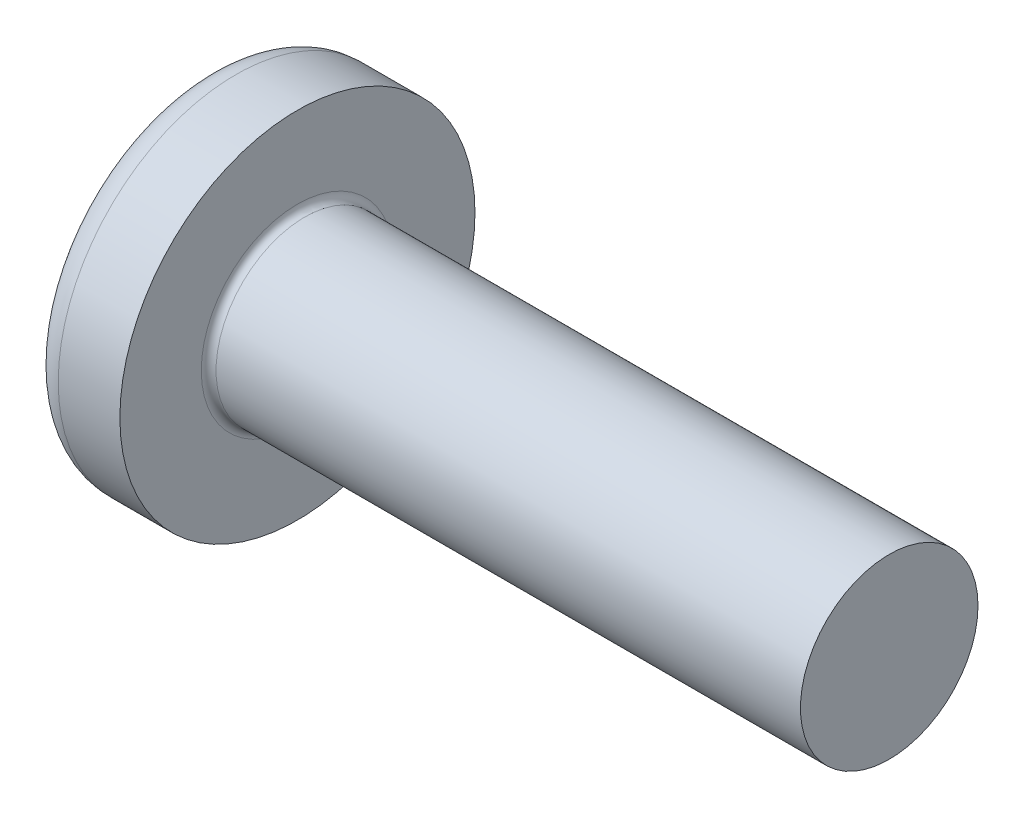
ISO-10303-21;
HEADER;
FILE_DESCRIPTION(('STEP AP214'),'2;1');
FILE_NAME('part.step','',(''),(''),'','','');
FILE_SCHEMA(('AUTOMOTIVE_DESIGN { 1 0 10303 214 1 1 1 1 }'));
ENDSEC;
DATA;
#1=APPLICATION_CONTEXT('core data for automotive mechanical design processes');
#2=APPLICATION_PROTOCOL_DEFINITION('international standard','automotive_design',2000,#1);
#3=PRODUCT_CONTEXT('',#1,'mechanical');
#4=PRODUCT('Part','Part','',(#3));
#5=PRODUCT_RELATED_PRODUCT_CATEGORY('part','',(#4));
#6=PRODUCT_DEFINITION_FORMATION('','',#4);
#7=PRODUCT_DEFINITION_CONTEXT('part definition',#1,'design');
#8=PRODUCT_DEFINITION('design','',#6,#7);
#9=PRODUCT_DEFINITION_SHAPE('','',#8);
#10=(LENGTH_UNIT() NAMED_UNIT(*) SI_UNIT(.MILLI.,.METRE.));
#11=(NAMED_UNIT(*) PLANE_ANGLE_UNIT() SI_UNIT($,.RADIAN.));
#12=(NAMED_UNIT(*) SI_UNIT($,.STERADIAN.) SOLID_ANGLE_UNIT());
#13=UNCERTAINTY_MEASURE_WITH_UNIT(LENGTH_MEASURE(1.E-05),#10,'distance_accuracy_value','');
#14=(GEOMETRIC_REPRESENTATION_CONTEXT(3) GLOBAL_UNCERTAINTY_ASSIGNED_CONTEXT((#13)) GLOBAL_UNIT_ASSIGNED_CONTEXT((#10,
#11,#12)) REPRESENTATION_CONTEXT('',''));
#15=CARTESIAN_POINT('',(0.,0.,0.));
#16=DIRECTION('',(0.,0.,1.));
#17=DIRECTION('',(1.,0.,0.));
#18=AXIS2_PLACEMENT_3D('',#15,#16,#17);
#19=CARTESIAN_POINT('',(10.,0.,0.));
#20=DIRECTION('',(-1.,0.,0.));
#21=DIRECTION('',(0.,-1.,0.));
#22=AXIS2_PLACEMENT_3D('',#19,#20,#21);
#23=SPHERICAL_SURFACE('',#22,10.);
#24=CARTESIAN_POINT('',(1.68520580716902,0.,0.));
#25=DIRECTION('',(1.,0.,0.));
#26=DIRECTION('',(0.,0.,-1.));
#27=AXIS2_PLACEMENT_3D('',#24,#25,#26);
#28=CIRCLE('',#27,5.55555555555556);
#29=CARTESIAN_POINT('',(1.68520580716902,0.,-5.55555555555556));
#30=VERTEX_POINT('',#29);
#31=EDGE_CURVE('E46',#30,#30,#28,.F.);
#32=ORIENTED_EDGE('',*,*,#31,.T.);
#33=EDGE_LOOP('',(#32));
#34=FACE_BOUND('',#33,.T.);
#35=CARTESIAN_POINT('',(10.,-2.075,0.));
#36=DIRECTION('',(0.,1.,0.));
#37=DIRECTION('',(0.,0.,1.));
#38=AXIS2_PLACEMENT_3D('',#35,#36,#37);
#39=CIRCLE('',#38,9.78235017774358);
#40=CARTESIAN_POINT('',(0.291283984652422,-2.075,1.19800180856847));
#41=VERTEX_POINT('',#40);
#42=CARTESIAN_POINT('',(0.291283984652422,-2.075,-1.19800180856848));
#43=VERTEX_POINT('',#42);
#44=EDGE_CURVE('E152',#41,#43,#39,.F.);
#45=ORIENTED_EDGE('',*,*,#44,.T.);
#46=CARTESIAN_POINT('',(10.,-1.0375,-1.79700271285271));
#47=DIRECTION('',(0.,0.5,0.866025403784439));
#48=DIRECTION('',(0.,-0.866025403784439,0.5));
#49=AXIS2_PLACEMENT_3D('',#46,#47,#48);
#50=CIRCLE('',#49,9.78235017774358);
#51=CARTESIAN_POINT('',(0.29128398465242,0.,-2.39600361713695));
#52=VERTEX_POINT('',#51);
#53=EDGE_CURVE('E162',#43,#52,#50,.F.);
#54=ORIENTED_EDGE('',*,*,#53,.T.);
#55=CARTESIAN_POINT('',(10.,1.0375,-1.79700271285271));
#56=DIRECTION('',(0.,-0.5,0.866025403784439));
#57=DIRECTION('',(0.,-0.866025403784439,-0.5));
#58=AXIS2_PLACEMENT_3D('',#55,#56,#57);
#59=CIRCLE('',#58,9.78235017774359);
#60=CARTESIAN_POINT('',(0.29128398465242,2.075,-1.19800180856847));
#61=VERTEX_POINT('',#60);
#62=EDGE_CURVE('E61',#52,#61,#59,.F.);
#63=ORIENTED_EDGE('',*,*,#62,.T.);
#64=CARTESIAN_POINT('',(10.,2.075,0.));
#65=DIRECTION('',(0.,-1.,0.));
#66=DIRECTION('',(0.,0.,-1.));
#67=AXIS2_PLACEMENT_3D('',#64,#65,#66);
#68=CIRCLE('',#67,9.78235017774359);
#69=CARTESIAN_POINT('',(0.29128398465242,2.075,1.19800180856847));
#70=VERTEX_POINT('',#69);
#71=EDGE_CURVE('E159',#61,#70,#68,.F.);
#72=ORIENTED_EDGE('',*,*,#71,.T.);
#73=CARTESIAN_POINT('',(10.,1.0375,1.79700271285271));
#74=DIRECTION('',(0.,-0.5,-0.866025403784439));
#75=DIRECTION('',(0.,0.866025403784438,-0.5));
#76=AXIS2_PLACEMENT_3D('',#73,#74,#75);
#77=CIRCLE('',#76,9.78235017774359);
#78=CARTESIAN_POINT('',(0.29128398465242,0.,2.39600361713695));
#79=VERTEX_POINT('',#78);
#80=EDGE_CURVE('E129',#70,#79,#77,.F.);
#81=ORIENTED_EDGE('',*,*,#80,.T.);
#82=CARTESIAN_POINT('',(10.,-1.0375,1.79700271285271));
#83=DIRECTION('',(0.,0.5,-0.866025403784438));
#84=DIRECTION('',(0.,0.866025403784438,0.5));
#85=AXIS2_PLACEMENT_3D('',#82,#83,#84);
#86=CIRCLE('',#85,9.78235017774359);
#87=EDGE_CURVE('E155',#79,#41,#86,.F.);
#88=ORIENTED_EDGE('',*,*,#87,.T.);
#89=EDGE_LOOP('',(#45,#54,#63,#72,#81,#88));
#90=FACE_BOUND('',#89,.T.);
#91=ADVANCED_FACE('F38',(#34,#90),#23,.T.);
#92=CARTESIAN_POINT('',(4.6,0.,0.));
#93=DIRECTION('',(-1.,0.,0.));
#94=DIRECTION('',(0.,0.,1.));
#95=AXIS2_PLACEMENT_3D('',#92,#93,#94);
#96=CYLINDRICAL_SURFACE('',#95,6.);
#97=CARTESIAN_POINT('',(2.51668522645212,0.,0.));
#98=DIRECTION('',(1.,0.,0.));
#99=DIRECTION('',(0.,0.,-1.));
#100=AXIS2_PLACEMENT_3D('',#97,#98,#99);
#101=CIRCLE('',#100,6.);
#102=CARTESIAN_POINT('',(2.51668522645212,0.,-6.));
#103=VERTEX_POINT('',#102);
#104=EDGE_CURVE('E11',#103,#103,#101,.T.);
#105=ORIENTED_EDGE('',*,*,#104,.T.);
#106=EDGE_LOOP('',(#105));
#107=FACE_BOUND('',#106,.T.);
#108=CARTESIAN_POINT('',(4.6,0.,0.));
#109=DIRECTION('',(1.,0.,0.));
#110=DIRECTION('',(0.,0.,-1.));
#111=AXIS2_PLACEMENT_3D('',#108,#109,#110);
#112=CIRCLE('',#111,6.);
#113=CARTESIAN_POINT('',(4.6,0.,-6.));
#114=VERTEX_POINT('',#113);
#115=EDGE_CURVE('E142',#114,#114,#112,.T.);
#116=ORIENTED_EDGE('',*,*,#115,.F.);
#117=EDGE_LOOP('',(#116));
#118=FACE_BOUND('',#117,.T.);
#119=ADVANCED_FACE('F178',(#107,#118),#96,.T.);
#120=CARTESIAN_POINT('',(4.6,0.,0.));
#121=DIRECTION('',(1.,0.,0.));
#122=DIRECTION('',(0.,0.,-1.));
#123=AXIS2_PLACEMENT_3D('',#120,#121,#122);
#124=PLANE('',#123);
#125=CARTESIAN_POINT('',(4.6,0.,0.));
#126=DIRECTION('',(1.,0.,0.));
#127=DIRECTION('',(0.,0.,-1.));
#128=AXIS2_PLACEMENT_3D('',#125,#126,#127);
#129=CIRCLE('',#128,3.25);
#130=CARTESIAN_POINT('',(4.6,0.,-3.25));
#131=VERTEX_POINT('',#130);
#132=EDGE_CURVE('E149',#131,#131,#129,.F.);
#133=ORIENTED_EDGE('',*,*,#132,.T.);
#134=EDGE_LOOP('',(#133));
#135=FACE_BOUND('',#134,.T.);
#136=ORIENTED_EDGE('',*,*,#115,.T.);
#137=EDGE_LOOP('',(#136));
#138=FACE_BOUND('',#137,.T.);
#139=ADVANCED_FACE('F183',(#135,#138),#124,.T.);
#140=CARTESIAN_POINT('',(24.6,0.,0.));
#141=DIRECTION('',(-1.,0.,0.));
#142=DIRECTION('',(0.,0.,1.));
#143=AXIS2_PLACEMENT_3D('',#140,#141,#142);
#144=CYLINDRICAL_SURFACE('',#143,3.);
#145=CARTESIAN_POINT('',(4.85,0.,0.));
#146=DIRECTION('',(1.,0.,0.));
#147=DIRECTION('',(0.,0.,-1.));
#148=AXIS2_PLACEMENT_3D('',#145,#146,#147);
#149=CIRCLE('',#148,3.);
#150=CARTESIAN_POINT('',(4.85,0.,-3.));
#151=VERTEX_POINT('',#150);
#152=EDGE_CURVE('E146',#151,#151,#149,.T.);
#153=ORIENTED_EDGE('',*,*,#152,.T.);
#154=EDGE_LOOP('',(#153));
#155=FACE_BOUND('',#154,.T.);
#156=CARTESIAN_POINT('',(24.6,0.,0.));
#157=DIRECTION('',(1.,0.,0.));
#158=DIRECTION('',(0.,0.,-1.));
#159=AXIS2_PLACEMENT_3D('',#156,#157,#158);
#160=CIRCLE('',#159,3.);
#161=CARTESIAN_POINT('',(24.6,0.,-3.));
#162=VERTEX_POINT('',#161);
#163=EDGE_CURVE('E139',#162,#162,#160,.T.);
#164=ORIENTED_EDGE('',*,*,#163,.F.);
#165=EDGE_LOOP('',(#164));
#166=FACE_BOUND('',#165,.T.);
#167=ADVANCED_FACE('F194',(#155,#166),#144,.T.);
#168=CARTESIAN_POINT('',(24.6,0.,0.));
#169=DIRECTION('',(1.,0.,0.));
#170=DIRECTION('',(0.,0.,-1.));
#171=AXIS2_PLACEMENT_3D('',#168,#169,#170);
#172=PLANE('',#171);
#173=ORIENTED_EDGE('',*,*,#163,.T.);
#174=EDGE_LOOP('',(#173));
#175=FACE_BOUND('',#174,.T.);
#176=ADVANCED_FACE('F190',(#175),#172,.T.);
#177=CARTESIAN_POINT('',(4.85,0.,0.));
#178=DIRECTION('',(1.,0.,0.));
#179=DIRECTION('',(0.,0.,-1.));
#180=AXIS2_PLACEMENT_3D('',#177,#178,#179);
#181=TOROIDAL_SURFACE('',#180,3.25,0.25);
#182=ORIENTED_EDGE('',*,*,#132,.F.);
#183=EDGE_LOOP('',(#182));
#184=FACE_BOUND('',#183,.T.);
#185=ORIENTED_EDGE('',*,*,#152,.F.);
#186=EDGE_LOOP('',(#185));
#187=FACE_BOUND('',#186,.T.);
#188=ADVANCED_FACE('F193',(#184,#187),#181,.F.);
#189=CARTESIAN_POINT('',(2.,-2.075,-1.19800180856848));
#190=DIRECTION('',(0.,0.5,0.866025403784439));
#191=DIRECTION('',(0.,-0.866025403784439,0.5));
#192=AXIS2_PLACEMENT_3D('',#189,#190,#191);
#193=PLANE('',#192);
#194=DIRECTION('',(-1.,0.,0.));
#195=VECTOR('',#194,1.);
#196=CARTESIAN_POINT('',(2.,-2.075,-1.19800180856848));
#197=LINE('',#196,#195);
#198=CARTESIAN_POINT('',(2.,-2.075,-1.19800180856848));
#199=VERTEX_POINT('',#198);
#200=EDGE_CURVE('E53',#199,#43,#197,.T.);
#201=ORIENTED_EDGE('',*,*,#200,.F.);
#202=DIRECTION('',(0.,0.866025403784439,-0.5));
#203=VECTOR('',#202,1.);
#204=CARTESIAN_POINT('',(2.,-2.075,-1.19800180856848));
#205=LINE('',#204,#203);
#206=CARTESIAN_POINT('',(2.,0.,-2.39600361713695));
#207=VERTEX_POINT('',#206);
#208=EDGE_CURVE('E221',#199,#207,#205,.T.);
#209=ORIENTED_EDGE('',*,*,#208,.T.);
#210=DIRECTION('',(-1.,0.,0.));
#211=VECTOR('',#210,1.);
#212=CARTESIAN_POINT('',(2.,0.,-2.39600361713695));
#213=LINE('',#212,#211);
#214=EDGE_CURVE('E132',#207,#52,#213,.T.);
#215=ORIENTED_EDGE('',*,*,#214,.T.);
#216=ORIENTED_EDGE('',*,*,#53,.F.);
#217=EDGE_LOOP('',(#201,#209,#215,#216));
#218=FACE_BOUND('',#217,.T.);
#219=ADVANCED_FACE('F188',(#218),#193,.T.);
#220=CARTESIAN_POINT('',(2.,0.,-2.39600361713695));
#221=DIRECTION('',(0.,-0.5,0.866025403784439));
#222=DIRECTION('',(0.,-0.866025403784439,-0.5));
#223=AXIS2_PLACEMENT_3D('',#220,#221,#222);
#224=PLANE('',#223);
#225=ORIENTED_EDGE('',*,*,#214,.F.);
#226=DIRECTION('',(0.,0.866025403784438,0.5));
#227=VECTOR('',#226,1.);
#228=CARTESIAN_POINT('',(2.,0.,-2.39600361713695));
#229=LINE('',#228,#227);
#230=CARTESIAN_POINT('',(2.,2.075,-1.19800180856847));
#231=VERTEX_POINT('',#230);
#232=EDGE_CURVE('E125',#207,#231,#229,.T.);
#233=ORIENTED_EDGE('',*,*,#232,.T.);
#234=DIRECTION('',(-1.,0.,0.));
#235=VECTOR('',#234,1.);
#236=CARTESIAN_POINT('',(2.,2.075,-1.19800180856847));
#237=LINE('',#236,#235);
#238=EDGE_CURVE('E124',#231,#61,#237,.T.);
#239=ORIENTED_EDGE('',*,*,#238,.T.);
#240=ORIENTED_EDGE('',*,*,#62,.F.);
#241=EDGE_LOOP('',(#225,#233,#239,#240));
#242=FACE_BOUND('',#241,.T.);
#243=ADVANCED_FACE('F206',(#242),#224,.T.);
#244=CARTESIAN_POINT('',(2.,2.075,-1.19800180856847));
#245=DIRECTION('',(0.,-1.,0.));
#246=DIRECTION('',(0.,0.,-1.));
#247=AXIS2_PLACEMENT_3D('',#244,#245,#246);
#248=PLANE('',#247);
#249=ORIENTED_EDGE('',*,*,#238,.F.);
#250=DIRECTION('',(0.,0.,1.));
#251=VECTOR('',#250,1.);
#252=CARTESIAN_POINT('',(2.,2.075,-1.19800180856847));
#253=LINE('',#252,#251);
#254=CARTESIAN_POINT('',(2.,2.075,1.19800180856847));
#255=VERTEX_POINT('',#254);
#256=EDGE_CURVE('E101',#231,#255,#253,.T.);
#257=ORIENTED_EDGE('',*,*,#256,.T.);
#258=DIRECTION('',(-1.,0.,0.));
#259=VECTOR('',#258,1.);
#260=CARTESIAN_POINT('',(2.,2.075,1.19800180856847));
#261=LINE('',#260,#259);
#262=EDGE_CURVE('E122',#255,#70,#261,.T.);
#263=ORIENTED_EDGE('',*,*,#262,.T.);
#264=ORIENTED_EDGE('',*,*,#71,.F.);
#265=EDGE_LOOP('',(#249,#257,#263,#264));
#266=FACE_BOUND('',#265,.T.);
#267=ADVANCED_FACE('F121',(#266),#248,.T.);
#268=CARTESIAN_POINT('',(2.,2.075,1.19800180856847));
#269=DIRECTION('',(0.,-0.5,-0.866025403784439));
#270=DIRECTION('',(0.,0.866025403784438,-0.5));
#271=AXIS2_PLACEMENT_3D('',#268,#269,#270);
#272=PLANE('',#271);
#273=ORIENTED_EDGE('',*,*,#262,.F.);
#274=DIRECTION('',(0.,-0.866025403784438,0.5));
#275=VECTOR('',#274,1.);
#276=CARTESIAN_POINT('',(2.,2.075,1.19800180856847));
#277=LINE('',#276,#275);
#278=CARTESIAN_POINT('',(2.,0.,2.39600361713695));
#279=VERTEX_POINT('',#278);
#280=EDGE_CURVE('E108',#255,#279,#277,.T.);
#281=ORIENTED_EDGE('',*,*,#280,.T.);
#282=DIRECTION('',(-1.,0.,0.));
#283=VECTOR('',#282,1.);
#284=CARTESIAN_POINT('',(2.,0.,2.39600361713695));
#285=LINE('',#284,#283);
#286=EDGE_CURVE('E130',#279,#79,#285,.T.);
#287=ORIENTED_EDGE('',*,*,#286,.T.);
#288=ORIENTED_EDGE('',*,*,#80,.F.);
#289=EDGE_LOOP('',(#273,#281,#287,#288));
#290=FACE_BOUND('',#289,.T.);
#291=ADVANCED_FACE('F127',(#290),#272,.T.);
#292=CARTESIAN_POINT('',(2.,0.,2.39600361713695));
#293=DIRECTION('',(0.,0.5,-0.866025403784438));
#294=DIRECTION('',(0.,0.866025403784438,0.5));
#295=AXIS2_PLACEMENT_3D('',#292,#293,#294);
#296=PLANE('',#295);
#297=ORIENTED_EDGE('',*,*,#286,.F.);
#298=DIRECTION('',(0.,-0.866025403784438,-0.5));
#299=VECTOR('',#298,1.);
#300=CARTESIAN_POINT('',(2.,0.,2.39600361713695));
#301=LINE('',#300,#299);
#302=CARTESIAN_POINT('',(2.,-2.075,1.19800180856847));
#303=VERTEX_POINT('',#302);
#304=EDGE_CURVE('E116',#279,#303,#301,.T.);
#305=ORIENTED_EDGE('',*,*,#304,.T.);
#306=DIRECTION('',(-1.,0.,0.));
#307=VECTOR('',#306,1.);
#308=CARTESIAN_POINT('',(2.,-2.075,1.19800180856847));
#309=LINE('',#308,#307);
#310=EDGE_CURVE('E134',#303,#41,#309,.T.);
#311=ORIENTED_EDGE('',*,*,#310,.T.);
#312=ORIENTED_EDGE('',*,*,#87,.F.);
#313=EDGE_LOOP('',(#297,#305,#311,#312));
#314=FACE_BOUND('',#313,.T.);
#315=ADVANCED_FACE('F245',(#314),#296,.T.);
#316=CARTESIAN_POINT('',(2.,-2.075,1.19800180856847));
#317=DIRECTION('',(0.,1.,0.));
#318=DIRECTION('',(0.,0.,1.));
#319=AXIS2_PLACEMENT_3D('',#316,#317,#318);
#320=PLANE('',#319);
#321=ORIENTED_EDGE('',*,*,#310,.F.);
#322=DIRECTION('',(0.,0.,-1.));
#323=VECTOR('',#322,1.);
#324=CARTESIAN_POINT('',(2.,-2.075,1.19800180856847));
#325=LINE('',#324,#323);
#326=EDGE_CURVE('E222',#303,#199,#325,.T.);
#327=ORIENTED_EDGE('',*,*,#326,.T.);
#328=ORIENTED_EDGE('',*,*,#200,.T.);
#329=ORIENTED_EDGE('',*,*,#44,.F.);
#330=EDGE_LOOP('',(#321,#327,#328,#329));
#331=FACE_BOUND('',#330,.T.);
#332=ADVANCED_FACE('F243',(#331),#320,.T.);
#333=CARTESIAN_POINT('',(2.,2.075,1.19800180856847));
#334=DIRECTION('',(0.86602540378444,0.249999999999999,0.433012701892218));
#335=DIRECTION('',(0.447213595499956,0.,-0.894427190999917));
#336=AXIS2_PLACEMENT_3D('',#333,#334,#335);
#337=PLANE('',#336);
#338=ORIENTED_EDGE('',*,*,#280,.F.);
#339=DIRECTION('',(-0.447213595499956,0.774596669241484,0.447213595499958));
#340=VECTOR('',#339,1.);
#341=CARTESIAN_POINT('',(2.,2.075,1.19800180856847));
#342=LINE('',#341,#340);
#343=CARTESIAN_POINT('',(3.19800180856847,0.,0.));
#344=VERTEX_POINT('',#343);
#345=EDGE_CURVE('E97',#344,#255,#342,.T.);
#346=ORIENTED_EDGE('',*,*,#345,.F.);
#347=DIRECTION('',(-0.447213595499956,0.,0.894427190999917));
#348=VECTOR('',#347,1.);
#349=CARTESIAN_POINT('',(2.,0.,2.39600361713695));
#350=LINE('',#349,#348);
#351=EDGE_CURVE('E110',#344,#279,#350,.T.);
#352=ORIENTED_EDGE('',*,*,#351,.T.);
#353=EDGE_LOOP('',(#338,#346,#352));
#354=FACE_BOUND('',#353,.T.);
#355=ADVANCED_FACE('F109',(#354),#337,.F.);
#356=CARTESIAN_POINT('',(2.,0.,2.39600361713695));
#357=DIRECTION('',(0.86602540378444,-0.249999999999999,0.433012701892217));
#358=DIRECTION('',(0.447213595499956,0.,-0.894427190999917));
#359=AXIS2_PLACEMENT_3D('',#356,#357,#358);
#360=PLANE('',#359);
#361=ORIENTED_EDGE('',*,*,#304,.F.);
#362=ORIENTED_EDGE('',*,*,#351,.F.);
#363=DIRECTION('',(-0.447213595499956,-0.774596669241484,0.447213595499958));
#364=VECTOR('',#363,1.);
#365=CARTESIAN_POINT('',(2.,-2.075,1.19800180856847));
#366=LINE('',#365,#364);
#367=EDGE_CURVE('E232',#344,#303,#366,.T.);
#368=ORIENTED_EDGE('',*,*,#367,.T.);
#369=EDGE_LOOP('',(#361,#362,#368));
#370=FACE_BOUND('',#369,.T.);
#371=ADVANCED_FACE('F247',(#370),#360,.F.);
#372=CARTESIAN_POINT('',(2.,-2.075,1.19800180856847));
#373=DIRECTION('',(0.86602540378444,-0.499999999999998,0.));
#374=DIRECTION('',(0.499999999999998,0.86602540378444,0.));
#375=AXIS2_PLACEMENT_3D('',#372,#373,#374);
#376=PLANE('',#375);
#377=ORIENTED_EDGE('',*,*,#326,.F.);
#378=ORIENTED_EDGE('',*,*,#367,.F.);
#379=DIRECTION('',(-0.447213595499956,-0.774596669241484,-0.447213595499958));
#380=VECTOR('',#379,1.);
#381=CARTESIAN_POINT('',(2.,-2.075,-1.19800180856848));
#382=LINE('',#381,#380);
#383=EDGE_CURVE('E234',#344,#199,#382,.T.);
#384=ORIENTED_EDGE('',*,*,#383,.T.);
#385=EDGE_LOOP('',(#377,#378,#384));
#386=FACE_BOUND('',#385,.T.);
#387=ADVANCED_FACE('F251',(#386),#376,.F.);
#388=CARTESIAN_POINT('',(2.,-2.075,-1.19800180856848));
#389=DIRECTION('',(0.86602540378444,-0.249999999999999,-0.433012701892218));
#390=DIRECTION('',(-0.447213595499956,0.,-0.894427190999917));
#391=AXIS2_PLACEMENT_3D('',#388,#389,#390);
#392=PLANE('',#391);
#393=ORIENTED_EDGE('',*,*,#208,.F.);
#394=ORIENTED_EDGE('',*,*,#383,.F.);
#395=DIRECTION('',(-0.447213595499956,0.,-0.894427190999917));
#396=VECTOR('',#395,1.);
#397=CARTESIAN_POINT('',(2.,0.,-2.39600361713695));
#398=LINE('',#397,#396);
#399=EDGE_CURVE('E236',#344,#207,#398,.T.);
#400=ORIENTED_EDGE('',*,*,#399,.T.);
#401=EDGE_LOOP('',(#393,#394,#400));
#402=FACE_BOUND('',#401,.T.);
#403=ADVANCED_FACE('F253',(#402),#392,.F.);
#404=CARTESIAN_POINT('',(2.,0.,-2.39600361713695));
#405=DIRECTION('',(0.86602540378444,0.249999999999999,-0.433012701892217));
#406=DIRECTION('',(-0.447213595499956,0.,-0.894427190999917));
#407=AXIS2_PLACEMENT_3D('',#404,#405,#406);
#408=PLANE('',#407);
#409=ORIENTED_EDGE('',*,*,#232,.F.);
#410=ORIENTED_EDGE('',*,*,#399,.F.);
#411=DIRECTION('',(-0.447213595499956,0.774596669241484,-0.447213595499958));
#412=VECTOR('',#411,1.);
#413=CARTESIAN_POINT('',(2.,2.075,-1.19800180856847));
#414=LINE('',#413,#412);
#415=EDGE_CURVE('E103',#344,#231,#414,.T.);
#416=ORIENTED_EDGE('',*,*,#415,.T.);
#417=EDGE_LOOP('',(#409,#410,#416));
#418=FACE_BOUND('',#417,.T.);
#419=ADVANCED_FACE('F174',(#418),#408,.F.);
#420=CARTESIAN_POINT('',(2.,2.075,-1.19800180856847));
#421=DIRECTION('',(0.86602540378444,0.499999999999998,0.));
#422=DIRECTION('',(-0.499999999999998,0.86602540378444,0.));
#423=AXIS2_PLACEMENT_3D('',#420,#421,#422);
#424=PLANE('',#423);
#425=ORIENTED_EDGE('',*,*,#256,.F.);
#426=ORIENTED_EDGE('',*,*,#415,.F.);
#427=ORIENTED_EDGE('',*,*,#345,.T.);
#428=EDGE_LOOP('',(#425,#426,#427));
#429=FACE_BOUND('',#428,.T.);
#430=ADVANCED_FACE('F99',(#429),#424,.F.);
#431=CARTESIAN_POINT('',(2.51668522645212,0.,0.));
#432=DIRECTION('',(1.,0.,0.));
#433=DIRECTION('',(0.,0.,-1.));
#434=AXIS2_PLACEMENT_3D('',#431,#432,#433);
#435=TOROIDAL_SURFACE('',#434,5.,1.);
#436=ORIENTED_EDGE('',*,*,#104,.F.);
#437=EDGE_LOOP('',(#436));
#438=FACE_BOUND('',#437,.T.);
#439=ORIENTED_EDGE('',*,*,#31,.F.);
#440=EDGE_LOOP('',(#439));
#441=FACE_BOUND('',#440,.T.);
#442=ADVANCED_FACE('F40',(#438,#441),#435,.T.);
#443=CLOSED_SHELL('',(#91,#119,#139,#167,#176,#188,#219,#243,#267,#291,#315,#332,#355,#371,#387,
#403,#419,#430,#442));
#444=MANIFOLD_SOLID_BREP('B2',#443);
#445=ADVANCED_BREP_SHAPE_REPRESENTATION('',(#18,#444),#14);
#446=SHAPE_DEFINITION_REPRESENTATION(#9,#445);
ENDSEC;
END-ISO-10303-21;
